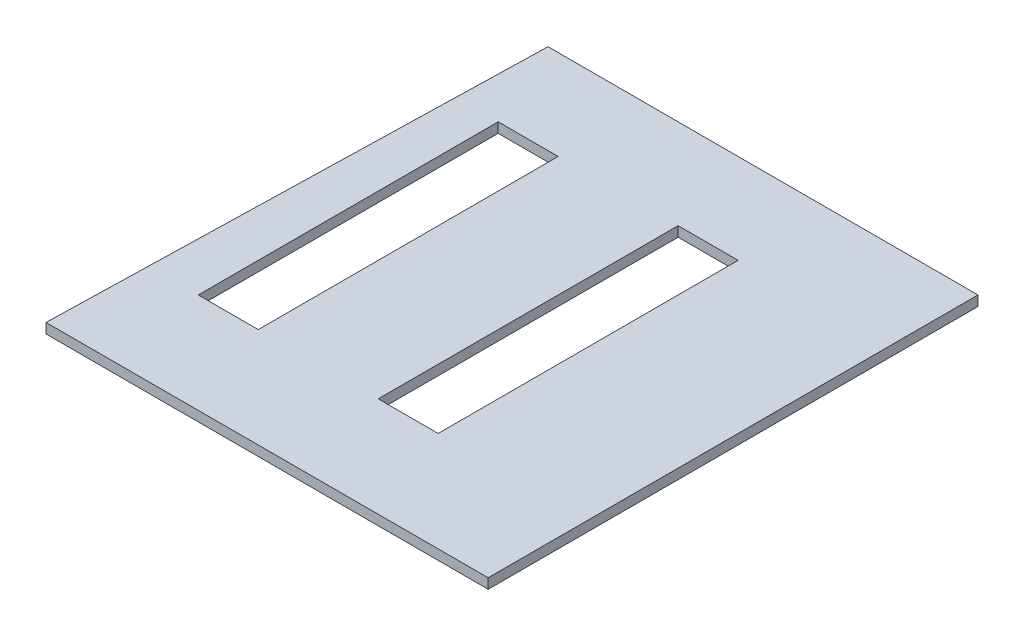
ISO-10303-21;
HEADER;
FILE_DESCRIPTION(('STEP AP214'),'2;1');
FILE_NAME('part.step','',(''),(''),'','','');
FILE_SCHEMA(('AUTOMOTIVE_DESIGN { 1 0 10303 214 1 1 1 1 }'));
ENDSEC;
DATA;
#1=APPLICATION_CONTEXT('core data for automotive mechanical design processes');
#2=APPLICATION_PROTOCOL_DEFINITION('international standard','automotive_design',2000,#1);
#3=PRODUCT_CONTEXT('',#1,'mechanical');
#4=PRODUCT('Part','Part','',(#3));
#5=PRODUCT_RELATED_PRODUCT_CATEGORY('part','',(#4));
#6=PRODUCT_DEFINITION_FORMATION('','',#4);
#7=PRODUCT_DEFINITION_CONTEXT('part definition',#1,'design');
#8=PRODUCT_DEFINITION('design','',#6,#7);
#9=PRODUCT_DEFINITION_SHAPE('','',#8);
#10=(LENGTH_UNIT() NAMED_UNIT(*) SI_UNIT(.MILLI.,.METRE.));
#11=(NAMED_UNIT(*) PLANE_ANGLE_UNIT() SI_UNIT($,.RADIAN.));
#12=(NAMED_UNIT(*) SI_UNIT($,.STERADIAN.) SOLID_ANGLE_UNIT());
#13=UNCERTAINTY_MEASURE_WITH_UNIT(LENGTH_MEASURE(1.E-05),#10,'distance_accuracy_value','');
#14=(GEOMETRIC_REPRESENTATION_CONTEXT(3) GLOBAL_UNCERTAINTY_ASSIGNED_CONTEXT((#13)) GLOBAL_UNIT_ASSIGNED_CONTEXT((#10,
#11,#12)) REPRESENTATION_CONTEXT('',''));
#15=CARTESIAN_POINT('',(0.,0.,0.));
#16=DIRECTION('',(0.,0.,1.));
#17=DIRECTION('',(1.,0.,0.));
#18=AXIS2_PLACEMENT_3D('',#15,#16,#17);
#19=CARTESIAN_POINT('',(1123.2636490684,50.8,-1244.26175662601));
#20=DIRECTION('',(-1.,0.,0.));
#21=DIRECTION('',(0.,0.,1.));
#22=AXIS2_PLACEMENT_3D('',#19,#20,#21);
#23=PLANE('',#22);
#24=DIRECTION('',(0.,0.,-1.));
#25=VECTOR('',#24,1.);
#26=CARTESIAN_POINT('',(1123.2636490684,0.,-1244.26175662601));
#27=LINE('',#26,#25);
#28=CARTESIAN_POINT('',(1123.2636490684,0.,1244.93824337399));
#29=VERTEX_POINT('',#28);
#30=CARTESIAN_POINT('',(1123.2636490684,0.,-1244.26175662601));
#31=VERTEX_POINT('',#30);
#32=EDGE_CURVE('E167',#29,#31,#27,.T.);
#33=ORIENTED_EDGE('',*,*,#32,.T.);
#34=DIRECTION('',(0.,-1.,0.));
#35=VECTOR('',#34,1.);
#36=CARTESIAN_POINT('',(1123.2636490684,50.8,-1244.26175662601));
#37=LINE('',#36,#35);
#38=CARTESIAN_POINT('',(1123.2636490684,50.8,-1244.26175662601));
#39=VERTEX_POINT('',#38);
#40=EDGE_CURVE('E11',#39,#31,#37,.T.);
#41=ORIENTED_EDGE('',*,*,#40,.F.);
#42=DIRECTION('',(0.,0.,-1.));
#43=VECTOR('',#42,1.);
#44=CARTESIAN_POINT('',(1123.2636490684,50.8,-1244.26175662601));
#45=LINE('',#44,#43);
#46=CARTESIAN_POINT('',(1123.2636490684,50.8,1244.93824337399));
#47=VERTEX_POINT('',#46);
#48=EDGE_CURVE('E196',#47,#39,#45,.T.);
#49=ORIENTED_EDGE('',*,*,#48,.F.);
#50=DIRECTION('',(0.,-1.,0.));
#51=VECTOR('',#50,1.);
#52=CARTESIAN_POINT('',(1123.2636490684,50.8,1244.93824337399));
#53=LINE('',#52,#51);
#54=EDGE_CURVE('E206',#47,#29,#53,.T.);
#55=ORIENTED_EDGE('',*,*,#54,.T.);
#56=EDGE_LOOP('',(#33,#41,#49,#55));
#57=FACE_BOUND('',#56,.T.);
#58=ADVANCED_FACE('F44',(#57),#23,.F.);
#59=CARTESIAN_POINT('',(-1061.8983509316,50.8,-1244.26175662601));
#60=DIRECTION('',(0.,0.,1.));
#61=DIRECTION('',(1.,0.,0.));
#62=AXIS2_PLACEMENT_3D('',#59,#60,#61);
#63=PLANE('',#62);
#64=DIRECTION('',(-1.,0.,0.));
#65=VECTOR('',#64,1.);
#66=CARTESIAN_POINT('',(-1061.8983509316,0.,-1244.26175662601));
#67=LINE('',#66,#65);
#68=CARTESIAN_POINT('',(-1061.8983509316,0.,-1244.26175662601));
#69=VERTEX_POINT('',#68);
#70=EDGE_CURVE('E209',#31,#69,#67,.T.);
#71=ORIENTED_EDGE('',*,*,#70,.T.);
#72=DIRECTION('',(0.,-1.,0.));
#73=VECTOR('',#72,1.);
#74=CARTESIAN_POINT('',(-1061.8983509316,50.8,-1244.26175662601));
#75=LINE('',#74,#73);
#76=CARTESIAN_POINT('',(-1061.8983509316,50.8,-1244.26175662601));
#77=VERTEX_POINT('',#76);
#78=EDGE_CURVE('E51',#77,#69,#75,.T.);
#79=ORIENTED_EDGE('',*,*,#78,.F.);
#80=DIRECTION('',(-1.,0.,0.));
#81=VECTOR('',#80,1.);
#82=CARTESIAN_POINT('',(-1061.8983509316,50.8,-1244.26175662601));
#83=LINE('',#82,#81);
#84=EDGE_CURVE('E199',#39,#77,#83,.T.);
#85=ORIENTED_EDGE('',*,*,#84,.F.);
#86=ORIENTED_EDGE('',*,*,#40,.T.);
#87=EDGE_LOOP('',(#71,#79,#85,#86));
#88=FACE_BOUND('',#87,.T.);
#89=ADVANCED_FACE('F238',(#88),#63,.F.);
#90=CARTESIAN_POINT('',(-1123.8743509316,50.8,1244.93824337399));
#91=DIRECTION('',(0.999690189847236,0.,0.0248902455431352));
#92=DIRECTION('',(0.0248902455431352,0.,-0.999690189847236));
#93=AXIS2_PLACEMENT_3D('',#90,#91,#92);
#94=PLANE('',#93);
#95=DIRECTION('',(-0.0248902455431352,0.,0.999690189847236));
#96=VECTOR('',#95,1.);
#97=CARTESIAN_POINT('',(-1123.8743509316,0.,1244.93824337399));
#98=LINE('',#97,#96);
#99=CARTESIAN_POINT('',(-1123.8743509316,0.,1244.93824337399));
#100=VERTEX_POINT('',#99);
#101=EDGE_CURVE('E211',#69,#100,#98,.T.);
#102=ORIENTED_EDGE('',*,*,#101,.T.);
#103=DIRECTION('',(0.,-1.,0.));
#104=VECTOR('',#103,1.);
#105=CARTESIAN_POINT('',(-1123.8743509316,50.8,1244.93824337399));
#106=LINE('',#105,#104);
#107=CARTESIAN_POINT('',(-1123.8743509316,50.8,1244.93824337399));
#108=VERTEX_POINT('',#107);
#109=EDGE_CURVE('E216',#108,#100,#106,.T.);
#110=ORIENTED_EDGE('',*,*,#109,.F.);
#111=DIRECTION('',(-0.0248902455431352,0.,0.999690189847236));
#112=VECTOR('',#111,1.);
#113=CARTESIAN_POINT('',(-1123.8743509316,50.8,1244.93824337399));
#114=LINE('',#113,#112);
#115=EDGE_CURVE('E202',#77,#108,#114,.T.);
#116=ORIENTED_EDGE('',*,*,#115,.F.);
#117=ORIENTED_EDGE('',*,*,#78,.T.);
#118=EDGE_LOOP('',(#102,#110,#116,#117));
#119=FACE_BOUND('',#118,.T.);
#120=ADVANCED_FACE('F223',(#119),#94,.F.);
#121=CARTESIAN_POINT('',(-1123.8743509316,50.8,1244.93824337399));
#122=DIRECTION('',(0.,0.,-1.));
#123=DIRECTION('',(-1.,0.,0.));
#124=AXIS2_PLACEMENT_3D('',#121,#122,#123);
#125=PLANE('',#124);
#126=DIRECTION('',(1.,0.,0.));
#127=VECTOR('',#126,1.);
#128=CARTESIAN_POINT('',(-1123.8743509316,0.,1244.93824337399));
#129=LINE('',#128,#127);
#130=EDGE_CURVE('E200',#100,#29,#129,.T.);
#131=ORIENTED_EDGE('',*,*,#130,.T.);
#132=ORIENTED_EDGE('',*,*,#54,.F.);
#133=DIRECTION('',(1.,0.,0.));
#134=VECTOR('',#133,1.);
#135=CARTESIAN_POINT('',(-1123.8743509316,50.8,1244.93824337399));
#136=LINE('',#135,#134);
#137=EDGE_CURVE('E204',#108,#47,#136,.T.);
#138=ORIENTED_EDGE('',*,*,#137,.F.);
#139=ORIENTED_EDGE('',*,*,#109,.T.);
#140=EDGE_LOOP('',(#131,#132,#138,#139));
#141=FACE_BOUND('',#140,.T.);
#142=ADVANCED_FACE('F232',(#141),#125,.F.);
#143=CARTESIAN_POINT('',(0.,50.8,0.));
#144=DIRECTION('',(0.,1.,0.));
#145=DIRECTION('',(0.,0.,1.));
#146=AXIS2_PLACEMENT_3D('',#143,#144,#145);
#147=PLANE('',#146);
#148=DIRECTION('',(0.,0.,-1.));
#149=VECTOR('',#148,1.);
#150=CARTESIAN_POINT('',(361.263649068402,50.8,736.938243373988));
#151=LINE('',#150,#149);
#152=CARTESIAN_POINT('',(361.263649068402,50.8,736.938243373988));
#153=VERTEX_POINT('',#152);
#154=CARTESIAN_POINT('',(361.263649068402,50.8,-787.061756626012));
#155=VERTEX_POINT('',#154);
#156=EDGE_CURVE('E58',#153,#155,#151,.T.);
#157=ORIENTED_EDGE('',*,*,#156,.F.);
#158=DIRECTION('',(1.,0.,0.));
#159=VECTOR('',#158,1.);
#160=CARTESIAN_POINT('',(56.4636490684018,50.8,736.938243373988));
#161=LINE('',#160,#159);
#162=CARTESIAN_POINT('',(56.4636490684018,50.8,736.938243373988));
#163=VERTEX_POINT('',#162);
#164=EDGE_CURVE('E156',#163,#153,#161,.T.);
#165=ORIENTED_EDGE('',*,*,#164,.F.);
#166=DIRECTION('',(0.,0.,1.));
#167=VECTOR('',#166,1.);
#168=CARTESIAN_POINT('',(56.4636490684018,50.8,736.938243373988));
#169=LINE('',#168,#167);
#170=CARTESIAN_POINT('',(56.4636490684018,50.8,-787.061756626012));
#171=VERTEX_POINT('',#170);
#172=EDGE_CURVE('E139',#171,#163,#169,.T.);
#173=ORIENTED_EDGE('',*,*,#172,.F.);
#174=DIRECTION('',(-1.,0.,0.));
#175=VECTOR('',#174,1.);
#176=CARTESIAN_POINT('',(56.4636490684018,50.8,-787.061756626012));
#177=LINE('',#176,#175);
#178=EDGE_CURVE('E149',#155,#171,#177,.T.);
#179=ORIENTED_EDGE('',*,*,#178,.F.);
#180=EDGE_LOOP('',(#157,#165,#173,#179));
#181=FACE_BOUND('',#180,.T.);
#182=DIRECTION('',(0.,0.,-1.));
#183=VECTOR('',#182,1.);
#184=CARTESIAN_POINT('',(-553.136350931598,50.8,736.938243373988));
#185=LINE('',#184,#183);
#186=CARTESIAN_POINT('',(-553.136350931598,50.8,736.938243373988));
#187=VERTEX_POINT('',#186);
#188=CARTESIAN_POINT('',(-553.136350931598,50.8,-787.061756626012));
#189=VERTEX_POINT('',#188);
#190=EDGE_CURVE('E66',#187,#189,#185,.T.);
#191=ORIENTED_EDGE('',*,*,#190,.F.);
#192=DIRECTION('',(1.,0.,0.));
#193=VECTOR('',#192,1.);
#194=CARTESIAN_POINT('',(-857.936350931598,50.8,736.938243373988));
#195=LINE('',#194,#193);
#196=CARTESIAN_POINT('',(-857.936350931598,50.8,736.938243373988));
#197=VERTEX_POINT('',#196);
#198=EDGE_CURVE('E185',#197,#187,#195,.T.);
#199=ORIENTED_EDGE('',*,*,#198,.F.);
#200=DIRECTION('',(0.,0.,1.));
#201=VECTOR('',#200,1.);
#202=CARTESIAN_POINT('',(-857.936350931598,50.8,736.938243373988));
#203=LINE('',#202,#201);
#204=CARTESIAN_POINT('',(-857.936350931598,50.8,-787.061756626012));
#205=VERTEX_POINT('',#204);
#206=EDGE_CURVE('E182',#205,#197,#203,.T.);
#207=ORIENTED_EDGE('',*,*,#206,.F.);
#208=DIRECTION('',(-1.,0.,0.));
#209=VECTOR('',#208,1.);
#210=CARTESIAN_POINT('',(-857.936350931598,50.8,-787.061756626012));
#211=LINE('',#210,#209);
#212=EDGE_CURVE('E179',#189,#205,#211,.T.);
#213=ORIENTED_EDGE('',*,*,#212,.F.);
#214=EDGE_LOOP('',(#191,#199,#207,#213));
#215=FACE_BOUND('',#214,.T.);
#216=ORIENTED_EDGE('',*,*,#48,.T.);
#217=ORIENTED_EDGE('',*,*,#84,.T.);
#218=ORIENTED_EDGE('',*,*,#115,.T.);
#219=ORIENTED_EDGE('',*,*,#137,.T.);
#220=EDGE_LOOP('',(#216,#217,#218,#219));
#221=FACE_BOUND('',#220,.T.);
#222=ADVANCED_FACE('F153',(#181,#215,#221),#147,.T.);
#223=CARTESIAN_POINT('',(0.,0.,0.));
#224=DIRECTION('',(0.,1.,0.));
#225=DIRECTION('',(0.,0.,1.));
#226=AXIS2_PLACEMENT_3D('',#223,#224,#225);
#227=PLANE('',#226);
#228=DIRECTION('',(-1.,0.,0.));
#229=VECTOR('',#228,1.);
#230=CARTESIAN_POINT('',(56.4636490684018,0.,736.938243373988));
#231=LINE('',#230,#229);
#232=CARTESIAN_POINT('',(361.263649068402,0.,736.938243373988));
#233=VERTEX_POINT('',#232);
#234=CARTESIAN_POINT('',(56.4636490684018,0.,736.938243373988));
#235=VERTEX_POINT('',#234);
#236=EDGE_CURVE('E282',#233,#235,#231,.T.);
#237=ORIENTED_EDGE('',*,*,#236,.F.);
#238=DIRECTION('',(0.,0.,1.));
#239=VECTOR('',#238,1.);
#240=CARTESIAN_POINT('',(361.263649068402,0.,736.938243373988));
#241=LINE('',#240,#239);
#242=CARTESIAN_POINT('',(361.263649068402,0.,-787.061756626012));
#243=VERTEX_POINT('',#242);
#244=EDGE_CURVE('E168',#243,#233,#241,.T.);
#245=ORIENTED_EDGE('',*,*,#244,.F.);
#246=DIRECTION('',(1.,0.,0.));
#247=VECTOR('',#246,1.);
#248=CARTESIAN_POINT('',(56.4636490684018,0.,-787.061756626012));
#249=LINE('',#248,#247);
#250=CARTESIAN_POINT('',(56.4636490684018,0.,-787.061756626012));
#251=VERTEX_POINT('',#250);
#252=EDGE_CURVE('E165',#251,#243,#249,.T.);
#253=ORIENTED_EDGE('',*,*,#252,.F.);
#254=DIRECTION('',(0.,0.,-1.));
#255=VECTOR('',#254,1.);
#256=CARTESIAN_POINT('',(56.4636490684018,0.,736.938243373988));
#257=LINE('',#256,#255);
#258=EDGE_CURVE('E142',#235,#251,#257,.T.);
#259=ORIENTED_EDGE('',*,*,#258,.F.);
#260=EDGE_LOOP('',(#237,#245,#253,#259));
#261=FACE_BOUND('',#260,.T.);
#262=DIRECTION('',(-1.,0.,0.));
#263=VECTOR('',#262,1.);
#264=CARTESIAN_POINT('',(-857.936350931598,0.,736.938243373988));
#265=LINE('',#264,#263);
#266=CARTESIAN_POINT('',(-553.136350931598,0.,736.938243373988));
#267=VERTEX_POINT('',#266);
#268=CARTESIAN_POINT('',(-857.936350931598,0.,736.938243373988));
#269=VERTEX_POINT('',#268);
#270=EDGE_CURVE('E172',#267,#269,#265,.T.);
#271=ORIENTED_EDGE('',*,*,#270,.F.);
#272=DIRECTION('',(0.,0.,1.));
#273=VECTOR('',#272,1.);
#274=CARTESIAN_POINT('',(-553.136350931598,0.,736.938243373988));
#275=LINE('',#274,#273);
#276=CARTESIAN_POINT('',(-553.136350931598,0.,-787.061756626012));
#277=VERTEX_POINT('',#276);
#278=EDGE_CURVE('E175',#277,#267,#275,.T.);
#279=ORIENTED_EDGE('',*,*,#278,.F.);
#280=DIRECTION('',(1.,0.,0.));
#281=VECTOR('',#280,1.);
#282=CARTESIAN_POINT('',(-857.936350931598,0.,-787.061756626012));
#283=LINE('',#282,#281);
#284=CARTESIAN_POINT('',(-857.936350931598,0.,-787.061756626012));
#285=VERTEX_POINT('',#284);
#286=EDGE_CURVE('E177',#285,#277,#283,.T.);
#287=ORIENTED_EDGE('',*,*,#286,.F.);
#288=DIRECTION('',(0.,0.,-1.));
#289=VECTOR('',#288,1.);
#290=CARTESIAN_POINT('',(-857.936350931598,0.,736.938243373988));
#291=LINE('',#290,#289);
#292=EDGE_CURVE('E169',#269,#285,#291,.T.);
#293=ORIENTED_EDGE('',*,*,#292,.F.);
#294=EDGE_LOOP('',(#271,#279,#287,#293));
#295=FACE_BOUND('',#294,.T.);
#296=ORIENTED_EDGE('',*,*,#32,.F.);
#297=ORIENTED_EDGE('',*,*,#130,.F.);
#298=ORIENTED_EDGE('',*,*,#101,.F.);
#299=ORIENTED_EDGE('',*,*,#70,.F.);
#300=EDGE_LOOP('',(#296,#297,#298,#299));
#301=FACE_BOUND('',#300,.T.);
#302=ADVANCED_FACE('F229',(#261,#295,#301),#227,.F.);
#303=CARTESIAN_POINT('',(-553.136350931598,-1554.18114774308,736.938243373988));
#304=DIRECTION('',(1.,0.,0.));
#305=DIRECTION('',(0.,0.,-1.));
#306=AXIS2_PLACEMENT_3D('',#303,#304,#305);
#307=PLANE('',#306);
#308=ORIENTED_EDGE('',*,*,#278,.T.);
#309=DIRECTION('',(0.,1.,0.));
#310=VECTOR('',#309,1.);
#311=CARTESIAN_POINT('',(-553.136350931598,-1554.18114774308,736.938243373988));
#312=LINE('',#311,#310);
#313=EDGE_CURVE('E173',#267,#187,#312,.T.);
#314=ORIENTED_EDGE('',*,*,#313,.T.);
#315=ORIENTED_EDGE('',*,*,#190,.T.);
#316=DIRECTION('',(0.,1.,0.));
#317=VECTOR('',#316,1.);
#318=CARTESIAN_POINT('',(-553.136350931598,-1554.18114774308,-787.061756626012));
#319=LINE('',#318,#317);
#320=EDGE_CURVE('E188',#277,#189,#319,.T.);
#321=ORIENTED_EDGE('',*,*,#320,.F.);
#322=EDGE_LOOP('',(#308,#314,#315,#321));
#323=FACE_BOUND('',#322,.T.);
#324=ADVANCED_FACE('F250',(#323),#307,.F.);
#325=CARTESIAN_POINT('',(-857.936350931598,-1554.18114774308,736.938243373988));
#326=DIRECTION('',(0.,0.,1.));
#327=DIRECTION('',(1.,0.,0.));
#328=AXIS2_PLACEMENT_3D('',#325,#326,#327);
#329=PLANE('',#328);
#330=ORIENTED_EDGE('',*,*,#270,.T.);
#331=DIRECTION('',(0.,1.,0.));
#332=VECTOR('',#331,1.);
#333=CARTESIAN_POINT('',(-857.936350931598,-1554.18114774308,736.938243373988));
#334=LINE('',#333,#332);
#335=EDGE_CURVE('E190',#269,#197,#334,.T.);
#336=ORIENTED_EDGE('',*,*,#335,.T.);
#337=ORIENTED_EDGE('',*,*,#198,.T.);
#338=ORIENTED_EDGE('',*,*,#313,.F.);
#339=EDGE_LOOP('',(#330,#336,#337,#338));
#340=FACE_BOUND('',#339,.T.);
#341=ADVANCED_FACE('F256',(#340),#329,.F.);
#342=CARTESIAN_POINT('',(-857.936350931598,-1554.18114774308,736.938243373988));
#343=DIRECTION('',(-1.,0.,0.));
#344=DIRECTION('',(0.,0.,1.));
#345=AXIS2_PLACEMENT_3D('',#342,#343,#344);
#346=PLANE('',#345);
#347=ORIENTED_EDGE('',*,*,#292,.T.);
#348=DIRECTION('',(0.,1.,0.));
#349=VECTOR('',#348,1.);
#350=CARTESIAN_POINT('',(-857.936350931598,-1554.18114774308,-787.061756626012));
#351=LINE('',#350,#349);
#352=EDGE_CURVE('E192',#285,#205,#351,.T.);
#353=ORIENTED_EDGE('',*,*,#352,.T.);
#354=ORIENTED_EDGE('',*,*,#206,.T.);
#355=ORIENTED_EDGE('',*,*,#335,.F.);
#356=EDGE_LOOP('',(#347,#353,#354,#355));
#357=FACE_BOUND('',#356,.T.);
#358=ADVANCED_FACE('F261',(#357),#346,.F.);
#359=CARTESIAN_POINT('',(-857.936350931598,-1554.18114774308,-787.061756626012));
#360=DIRECTION('',(0.,0.,-1.));
#361=DIRECTION('',(-1.,0.,0.));
#362=AXIS2_PLACEMENT_3D('',#359,#360,#361);
#363=PLANE('',#362);
#364=ORIENTED_EDGE('',*,*,#286,.T.);
#365=ORIENTED_EDGE('',*,*,#320,.T.);
#366=ORIENTED_EDGE('',*,*,#212,.T.);
#367=ORIENTED_EDGE('',*,*,#352,.F.);
#368=EDGE_LOOP('',(#364,#365,#366,#367));
#369=FACE_BOUND('',#368,.T.);
#370=ADVANCED_FACE('F257',(#369),#363,.F.);
#371=CARTESIAN_POINT('',(361.263649068402,-1554.18114774308,736.938243373988));
#372=DIRECTION('',(1.,0.,0.));
#373=DIRECTION('',(0.,0.,-1.));
#374=AXIS2_PLACEMENT_3D('',#371,#372,#373);
#375=PLANE('',#374);
#376=ORIENTED_EDGE('',*,*,#244,.T.);
#377=DIRECTION('',(0.,1.,0.));
#378=VECTOR('',#377,1.);
#379=CARTESIAN_POINT('',(361.263649068402,-1554.18114774308,736.938243373988));
#380=LINE('',#379,#378);
#381=EDGE_CURVE('E161',#233,#153,#380,.T.);
#382=ORIENTED_EDGE('',*,*,#381,.T.);
#383=ORIENTED_EDGE('',*,*,#156,.T.);
#384=DIRECTION('',(0.,1.,0.));
#385=VECTOR('',#384,1.);
#386=CARTESIAN_POINT('',(361.263649068402,-1554.18114774308,-787.061756626012));
#387=LINE('',#386,#385);
#388=EDGE_CURVE('E146',#243,#155,#387,.T.);
#389=ORIENTED_EDGE('',*,*,#388,.F.);
#390=EDGE_LOOP('',(#376,#382,#383,#389));
#391=FACE_BOUND('',#390,.T.);
#392=ADVANCED_FACE('F260',(#391),#375,.F.);
#393=CARTESIAN_POINT('',(56.4636490684018,-1554.18114774308,736.938243373988));
#394=DIRECTION('',(0.,0.,1.));
#395=DIRECTION('',(1.,0.,0.));
#396=AXIS2_PLACEMENT_3D('',#393,#394,#395);
#397=PLANE('',#396);
#398=ORIENTED_EDGE('',*,*,#236,.T.);
#399=DIRECTION('',(0.,1.,0.));
#400=VECTOR('',#399,1.);
#401=CARTESIAN_POINT('',(56.4636490684018,-1554.18114774308,736.938243373988));
#402=LINE('',#401,#400);
#403=EDGE_CURVE('E145',#235,#163,#402,.T.);
#404=ORIENTED_EDGE('',*,*,#403,.T.);
#405=ORIENTED_EDGE('',*,*,#164,.T.);
#406=ORIENTED_EDGE('',*,*,#381,.F.);
#407=EDGE_LOOP('',(#398,#404,#405,#406));
#408=FACE_BOUND('',#407,.T.);
#409=ADVANCED_FACE('F271',(#408),#397,.F.);
#410=CARTESIAN_POINT('',(56.4636490684018,-1554.18114774308,736.938243373988));
#411=DIRECTION('',(-1.,0.,0.));
#412=DIRECTION('',(0.,0.,1.));
#413=AXIS2_PLACEMENT_3D('',#410,#411,#412);
#414=PLANE('',#413);
#415=ORIENTED_EDGE('',*,*,#258,.T.);
#416=DIRECTION('',(0.,1.,0.));
#417=VECTOR('',#416,1.);
#418=CARTESIAN_POINT('',(56.4636490684018,-1554.18114774308,-787.061756626012));
#419=LINE('',#418,#417);
#420=EDGE_CURVE('E134',#251,#171,#419,.T.);
#421=ORIENTED_EDGE('',*,*,#420,.T.);
#422=ORIENTED_EDGE('',*,*,#172,.T.);
#423=ORIENTED_EDGE('',*,*,#403,.F.);
#424=EDGE_LOOP('',(#415,#421,#422,#423));
#425=FACE_BOUND('',#424,.T.);
#426=ADVANCED_FACE('F136',(#425),#414,.F.);
#427=CARTESIAN_POINT('',(56.4636490684018,-1554.18114774308,-787.061756626012));
#428=DIRECTION('',(0.,0.,-1.));
#429=DIRECTION('',(-1.,0.,0.));
#430=AXIS2_PLACEMENT_3D('',#427,#428,#429);
#431=PLANE('',#430);
#432=ORIENTED_EDGE('',*,*,#252,.T.);
#433=ORIENTED_EDGE('',*,*,#388,.T.);
#434=ORIENTED_EDGE('',*,*,#178,.T.);
#435=ORIENTED_EDGE('',*,*,#420,.F.);
#436=EDGE_LOOP('',(#432,#433,#434,#435));
#437=FACE_BOUND('',#436,.T.);
#438=ADVANCED_FACE('F150',(#437),#431,.F.);
#439=CLOSED_SHELL('',(#58,#89,#120,#142,#222,#302,#324,#341,#358,#370,#392,#409,#426,#438));
#440=MANIFOLD_SOLID_BREP('B2',#439);
#441=ADVANCED_BREP_SHAPE_REPRESENTATION('',(#18,#440),#14);
#442=SHAPE_DEFINITION_REPRESENTATION(#9,#441);
ENDSEC;
END-ISO-10303-21;
